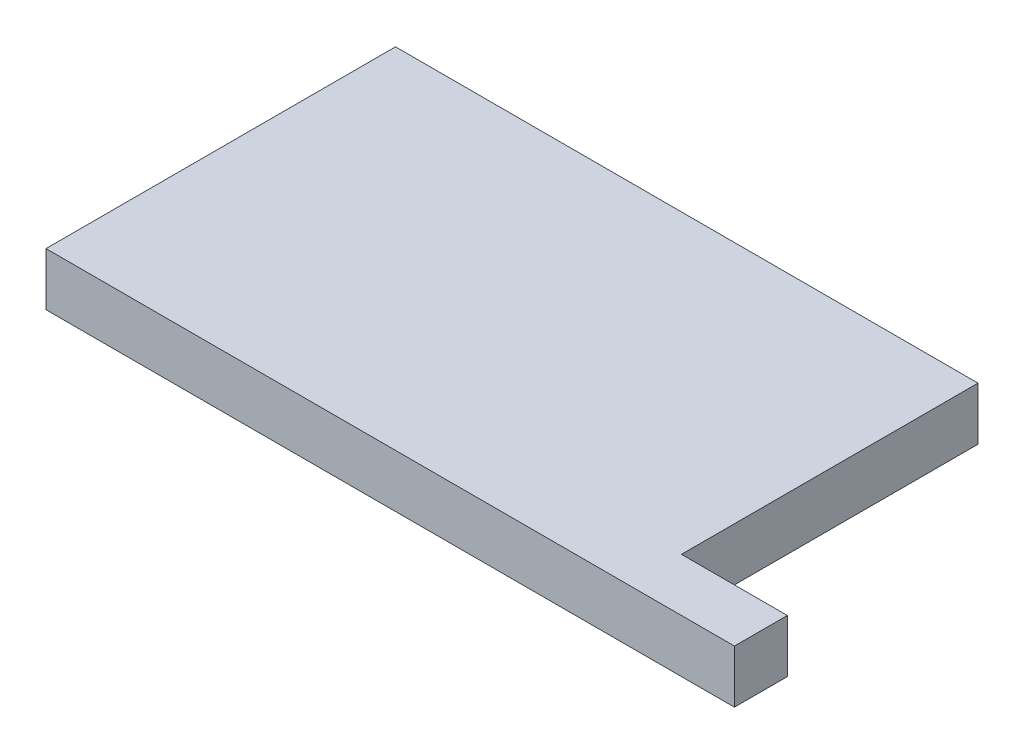
ISO-10303-21;
HEADER;
FILE_DESCRIPTION(('STEP AP214'),'2;1');
FILE_NAME('part.step','',(''),(''),'','','');
FILE_SCHEMA(('AUTOMOTIVE_DESIGN { 1 0 10303 214 1 1 1 1 }'));
ENDSEC;
DATA;
#1=APPLICATION_CONTEXT('core data for automotive mechanical design processes');
#2=APPLICATION_PROTOCOL_DEFINITION('international standard','automotive_design',2000,#1);
#3=PRODUCT_CONTEXT('',#1,'mechanical');
#4=PRODUCT('Part','Part','',(#3));
#5=PRODUCT_RELATED_PRODUCT_CATEGORY('part','',(#4));
#6=PRODUCT_DEFINITION_FORMATION('','',#4);
#7=PRODUCT_DEFINITION_CONTEXT('part definition',#1,'design');
#8=PRODUCT_DEFINITION('design','',#6,#7);
#9=PRODUCT_DEFINITION_SHAPE('','',#8);
#10=(LENGTH_UNIT() NAMED_UNIT(*) SI_UNIT(.MILLI.,.METRE.));
#11=(NAMED_UNIT(*) PLANE_ANGLE_UNIT() SI_UNIT($,.RADIAN.));
#12=(NAMED_UNIT(*) SI_UNIT($,.STERADIAN.) SOLID_ANGLE_UNIT());
#13=UNCERTAINTY_MEASURE_WITH_UNIT(LENGTH_MEASURE(1.E-05),#10,'distance_accuracy_value','');
#14=(GEOMETRIC_REPRESENTATION_CONTEXT(3) GLOBAL_UNCERTAINTY_ASSIGNED_CONTEXT((#13)) GLOBAL_UNIT_ASSIGNED_CONTEXT((#10,
#11,#12)) REPRESENTATION_CONTEXT('',''));
#15=CARTESIAN_POINT('',(0.,0.,0.));
#16=DIRECTION('',(0.,0.,1.));
#17=DIRECTION('',(1.,0.,0.));
#18=AXIS2_PLACEMENT_3D('',#15,#16,#17);
#19=CARTESIAN_POINT('',(0.,2.5,16.5));
#20=DIRECTION('',(0.,0.,-1.));
#21=DIRECTION('',(-1.,0.,0.));
#22=AXIS2_PLACEMENT_3D('',#19,#20,#21);
#23=PLANE('',#22);
#24=DIRECTION('',(1.,0.,0.));
#25=VECTOR('',#24,1.);
#26=CARTESIAN_POINT('',(0.,-2.5,16.5));
#27=LINE('',#26,#25);
#28=CARTESIAN_POINT('',(-27.5,-2.5,16.5));
#29=VERTEX_POINT('',#28);
#30=CARTESIAN_POINT('',(37.5,-2.5,16.5));
#31=VERTEX_POINT('',#30);
#32=EDGE_CURVE('E134',#29,#31,#27,.T.);
#33=ORIENTED_EDGE('',*,*,#32,.T.);
#34=DIRECTION('',(0.,-1.,0.));
#35=VECTOR('',#34,1.);
#36=CARTESIAN_POINT('',(37.5,2.5,16.5));
#37=LINE('',#36,#35);
#38=CARTESIAN_POINT('',(37.5,2.5,16.5));
#39=VERTEX_POINT('',#38);
#40=EDGE_CURVE('E11',#39,#31,#37,.T.);
#41=ORIENTED_EDGE('',*,*,#40,.F.);
#42=DIRECTION('',(1.,0.,0.));
#43=VECTOR('',#42,1.);
#44=CARTESIAN_POINT('',(0.,2.5,16.5));
#45=LINE('',#44,#43);
#46=CARTESIAN_POINT('',(-27.5,2.5,16.5));
#47=VERTEX_POINT('',#46);
#48=EDGE_CURVE('E154',#47,#39,#45,.T.);
#49=ORIENTED_EDGE('',*,*,#48,.F.);
#50=DIRECTION('',(0.,-1.,0.));
#51=VECTOR('',#50,1.);
#52=CARTESIAN_POINT('',(-27.5,2.5,16.5));
#53=LINE('',#52,#51);
#54=EDGE_CURVE('E62',#47,#29,#53,.T.);
#55=ORIENTED_EDGE('',*,*,#54,.T.);
#56=EDGE_LOOP('',(#33,#41,#49,#55));
#57=FACE_BOUND('',#56,.T.);
#58=ADVANCED_FACE('F45',(#57),#23,.F.);
#59=CARTESIAN_POINT('',(37.5,2.5,0.));
#60=DIRECTION('',(-1.,0.,0.));
#61=DIRECTION('',(0.,0.,1.));
#62=AXIS2_PLACEMENT_3D('',#59,#60,#61);
#63=PLANE('',#62);
#64=DIRECTION('',(0.,0.,-1.));
#65=VECTOR('',#64,1.);
#66=CARTESIAN_POINT('',(37.5,-2.5,0.));
#67=LINE('',#66,#65);
#68=CARTESIAN_POINT('',(37.5,-2.5,11.5));
#69=VERTEX_POINT('',#68);
#70=EDGE_CURVE('E137',#31,#69,#67,.T.);
#71=ORIENTED_EDGE('',*,*,#70,.T.);
#72=DIRECTION('',(0.,-1.,0.));
#73=VECTOR('',#72,1.);
#74=CARTESIAN_POINT('',(37.5,2.5,11.5));
#75=LINE('',#74,#73);
#76=CARTESIAN_POINT('',(37.5,2.5,11.5));
#77=VERTEX_POINT('',#76);
#78=EDGE_CURVE('E54',#77,#69,#75,.T.);
#79=ORIENTED_EDGE('',*,*,#78,.F.);
#80=DIRECTION('',(0.,0.,-1.));
#81=VECTOR('',#80,1.);
#82=CARTESIAN_POINT('',(37.5,2.5,0.));
#83=LINE('',#82,#81);
#84=EDGE_CURVE('E94',#39,#77,#83,.T.);
#85=ORIENTED_EDGE('',*,*,#84,.F.);
#86=ORIENTED_EDGE('',*,*,#40,.T.);
#87=EDGE_LOOP('',(#71,#79,#85,#86));
#88=FACE_BOUND('',#87,.T.);
#89=ADVANCED_FACE('F164',(#88),#63,.F.);
#90=CARTESIAN_POINT('',(0.,2.5,11.5));
#91=DIRECTION('',(0.,0.,-1.));
#92=DIRECTION('',(-1.,0.,0.));
#93=AXIS2_PLACEMENT_3D('',#90,#91,#92);
#94=PLANE('',#93);
#95=DIRECTION('',(1.,0.,0.));
#96=VECTOR('',#95,1.);
#97=CARTESIAN_POINT('',(0.,-2.5,11.5));
#98=LINE('',#97,#96);
#99=CARTESIAN_POINT('',(27.5,-2.5,11.5));
#100=VERTEX_POINT('',#99);
#101=EDGE_CURVE('E141',#100,#69,#98,.T.);
#102=ORIENTED_EDGE('',*,*,#101,.F.);
#103=DIRECTION('',(0.,-1.,0.));
#104=VECTOR('',#103,1.);
#105=CARTESIAN_POINT('',(27.5,2.5,11.5));
#106=LINE('',#105,#104);
#107=CARTESIAN_POINT('',(27.5,2.5,11.5));
#108=VERTEX_POINT('',#107);
#109=EDGE_CURVE('E124',#108,#100,#106,.T.);
#110=ORIENTED_EDGE('',*,*,#109,.F.);
#111=DIRECTION('',(1.,0.,0.));
#112=VECTOR('',#111,1.);
#113=CARTESIAN_POINT('',(0.,2.5,11.5));
#114=LINE('',#113,#112);
#115=EDGE_CURVE('E112',#108,#77,#114,.T.);
#116=ORIENTED_EDGE('',*,*,#115,.T.);
#117=ORIENTED_EDGE('',*,*,#78,.T.);
#118=EDGE_LOOP('',(#102,#110,#116,#117));
#119=FACE_BOUND('',#118,.T.);
#120=ADVANCED_FACE('F163',(#119),#94,.T.);
#121=CARTESIAN_POINT('',(27.5,2.5,0.));
#122=DIRECTION('',(-1.,0.,0.));
#123=DIRECTION('',(0.,0.,1.));
#124=AXIS2_PLACEMENT_3D('',#121,#122,#123);
#125=PLANE('',#124);
#126=DIRECTION('',(0.,0.,-1.));
#127=VECTOR('',#126,1.);
#128=CARTESIAN_POINT('',(27.5,-2.5,0.));
#129=LINE('',#128,#127);
#130=CARTESIAN_POINT('',(27.5,-2.5,-16.5));
#131=VERTEX_POINT('',#130);
#132=EDGE_CURVE('E120',#100,#131,#129,.T.);
#133=ORIENTED_EDGE('',*,*,#132,.T.);
#134=DIRECTION('',(0.,-1.,0.));
#135=VECTOR('',#134,1.);
#136=CARTESIAN_POINT('',(27.5,2.5,-16.5));
#137=LINE('',#136,#135);
#138=CARTESIAN_POINT('',(27.5,2.5,-16.5));
#139=VERTEX_POINT('',#138);
#140=EDGE_CURVE('E117',#139,#131,#137,.T.);
#141=ORIENTED_EDGE('',*,*,#140,.F.);
#142=DIRECTION('',(0.,0.,-1.));
#143=VECTOR('',#142,1.);
#144=CARTESIAN_POINT('',(27.5,2.5,0.));
#145=LINE('',#144,#143);
#146=EDGE_CURVE('E105',#108,#139,#145,.T.);
#147=ORIENTED_EDGE('',*,*,#146,.F.);
#148=ORIENTED_EDGE('',*,*,#109,.T.);
#149=EDGE_LOOP('',(#133,#141,#147,#148));
#150=FACE_BOUND('',#149,.T.);
#151=ADVANCED_FACE('F118',(#150),#125,.F.);
#152=CARTESIAN_POINT('',(0.,2.5,-16.5));
#153=DIRECTION('',(0.,0.,-1.));
#154=DIRECTION('',(-1.,0.,0.));
#155=AXIS2_PLACEMENT_3D('',#152,#153,#154);
#156=PLANE('',#155);
#157=DIRECTION('',(1.,0.,0.));
#158=VECTOR('',#157,1.);
#159=CARTESIAN_POINT('',(0.,-2.5,-16.5));
#160=LINE('',#159,#158);
#161=CARTESIAN_POINT('',(-27.5,-2.5,-16.5));
#162=VERTEX_POINT('',#161);
#163=EDGE_CURVE('E147',#162,#131,#160,.T.);
#164=ORIENTED_EDGE('',*,*,#163,.F.);
#165=DIRECTION('',(0.,-1.,0.));
#166=VECTOR('',#165,1.);
#167=CARTESIAN_POINT('',(-27.5,2.5,-16.5));
#168=LINE('',#167,#166);
#169=CARTESIAN_POINT('',(-27.5,2.5,-16.5));
#170=VERTEX_POINT('',#169);
#171=EDGE_CURVE('E82',#170,#162,#168,.T.);
#172=ORIENTED_EDGE('',*,*,#171,.F.);
#173=DIRECTION('',(1.,0.,0.));
#174=VECTOR('',#173,1.);
#175=CARTESIAN_POINT('',(0.,2.5,-16.5));
#176=LINE('',#175,#174);
#177=EDGE_CURVE('E110',#170,#139,#176,.T.);
#178=ORIENTED_EDGE('',*,*,#177,.T.);
#179=ORIENTED_EDGE('',*,*,#140,.T.);
#180=EDGE_LOOP('',(#164,#172,#178,#179));
#181=FACE_BOUND('',#180,.T.);
#182=ADVANCED_FACE('F126',(#181),#156,.T.);
#183=CARTESIAN_POINT('',(-27.5,2.5,0.));
#184=DIRECTION('',(-1.,0.,0.));
#185=DIRECTION('',(0.,0.,1.));
#186=AXIS2_PLACEMENT_3D('',#183,#184,#185);
#187=PLANE('',#186);
#188=DIRECTION('',(0.,0.,-1.));
#189=VECTOR('',#188,1.);
#190=CARTESIAN_POINT('',(-27.5,-2.5,0.));
#191=LINE('',#190,#189);
#192=EDGE_CURVE('E150',#29,#162,#191,.T.);
#193=ORIENTED_EDGE('',*,*,#192,.F.);
#194=ORIENTED_EDGE('',*,*,#54,.F.);
#195=DIRECTION('',(0.,0.,-1.));
#196=VECTOR('',#195,1.);
#197=CARTESIAN_POINT('',(-27.5,2.5,0.));
#198=LINE('',#197,#196);
#199=EDGE_CURVE('E128',#47,#170,#198,.T.);
#200=ORIENTED_EDGE('',*,*,#199,.T.);
#201=ORIENTED_EDGE('',*,*,#171,.T.);
#202=EDGE_LOOP('',(#193,#194,#200,#201));
#203=FACE_BOUND('',#202,.T.);
#204=ADVANCED_FACE('F168',(#203),#187,.T.);
#205=CARTESIAN_POINT('',(0.,2.5,0.));
#206=DIRECTION('',(0.,1.,0.));
#207=DIRECTION('',(0.,0.,1.));
#208=AXIS2_PLACEMENT_3D('',#205,#206,#207);
#209=PLANE('',#208);
#210=ORIENTED_EDGE('',*,*,#48,.T.);
#211=ORIENTED_EDGE('',*,*,#84,.T.);
#212=ORIENTED_EDGE('',*,*,#115,.F.);
#213=ORIENTED_EDGE('',*,*,#146,.T.);
#214=ORIENTED_EDGE('',*,*,#177,.F.);
#215=ORIENTED_EDGE('',*,*,#199,.F.);
#216=EDGE_LOOP('',(#210,#211,#212,#213,#214,#215));
#217=FACE_BOUND('',#216,.T.);
#218=ADVANCED_FACE('F107',(#217),#209,.T.);
#219=CARTESIAN_POINT('',(0.,-2.5,0.));
#220=DIRECTION('',(0.,1.,0.));
#221=DIRECTION('',(0.,0.,1.));
#222=AXIS2_PLACEMENT_3D('',#219,#220,#221);
#223=PLANE('',#222);
#224=ORIENTED_EDGE('',*,*,#32,.F.);
#225=ORIENTED_EDGE('',*,*,#192,.T.);
#226=ORIENTED_EDGE('',*,*,#163,.T.);
#227=ORIENTED_EDGE('',*,*,#132,.F.);
#228=ORIENTED_EDGE('',*,*,#101,.T.);
#229=ORIENTED_EDGE('',*,*,#70,.F.);
#230=EDGE_LOOP('',(#224,#225,#226,#227,#228,#229));
#231=FACE_BOUND('',#230,.T.);
#232=ADVANCED_FACE('F167',(#231),#223,.F.);
#233=CLOSED_SHELL('',(#58,#89,#120,#151,#182,#204,#218,#232));
#234=MANIFOLD_SOLID_BREP('B2',#233);
#235=ADVANCED_BREP_SHAPE_REPRESENTATION('',(#18,#234),#14);
#236=SHAPE_DEFINITION_REPRESENTATION(#9,#235);
ENDSEC;
END-ISO-10303-21;
